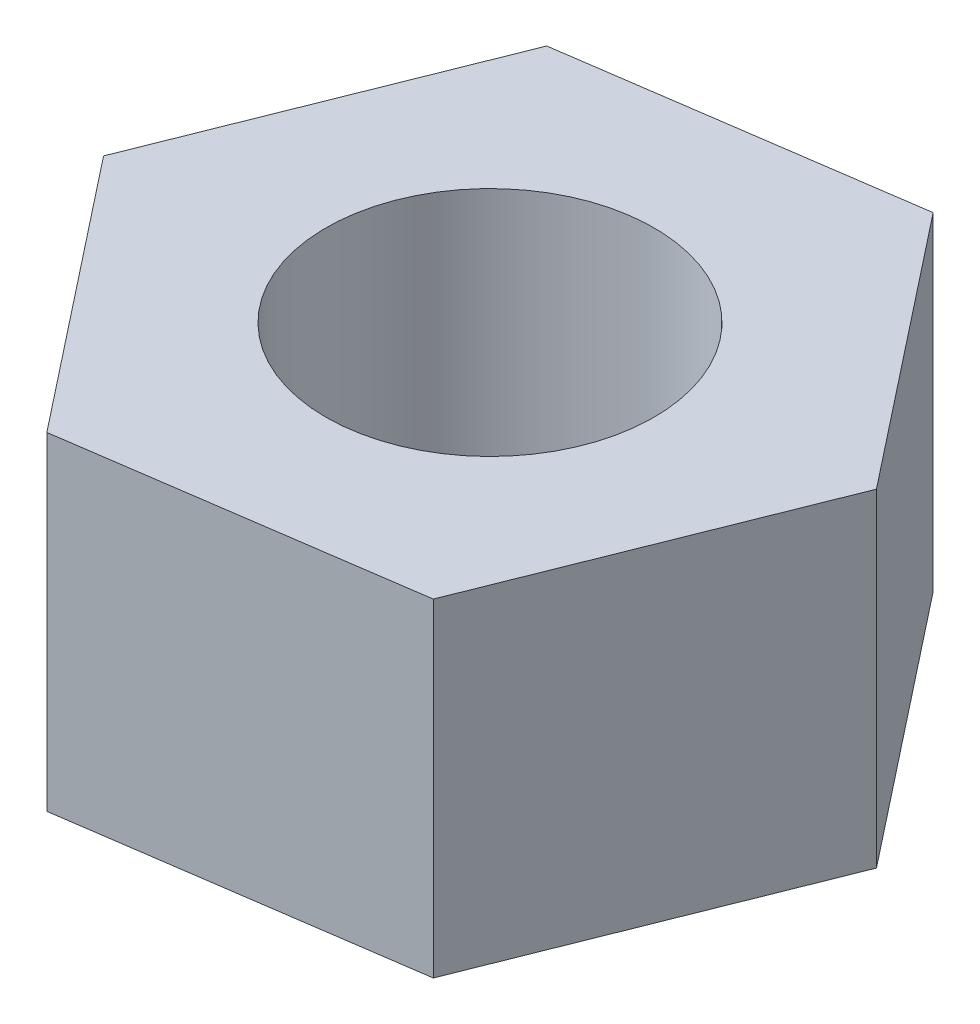
ISO-10303-21;
HEADER;
FILE_DESCRIPTION(('STEP AP214'),'2;1');
FILE_NAME('part.step','',(''),(''),'','','');
FILE_SCHEMA(('AUTOMOTIVE_DESIGN { 1 0 10303 214 1 1 1 1 }'));
ENDSEC;
DATA;
#1=APPLICATION_CONTEXT('core data for automotive mechanical design processes');
#2=APPLICATION_PROTOCOL_DEFINITION('international standard','automotive_design',2000,#1);
#3=PRODUCT_CONTEXT('',#1,'mechanical');
#4=PRODUCT('Part','Part','',(#3));
#5=PRODUCT_RELATED_PRODUCT_CATEGORY('part','',(#4));
#6=PRODUCT_DEFINITION_FORMATION('','',#4);
#7=PRODUCT_DEFINITION_CONTEXT('part definition',#1,'design');
#8=PRODUCT_DEFINITION('design','',#6,#7);
#9=PRODUCT_DEFINITION_SHAPE('','',#8);
#10=(LENGTH_UNIT() NAMED_UNIT(*) SI_UNIT(.MILLI.,.METRE.));
#11=(NAMED_UNIT(*) PLANE_ANGLE_UNIT() SI_UNIT($,.RADIAN.));
#12=(NAMED_UNIT(*) SI_UNIT($,.STERADIAN.) SOLID_ANGLE_UNIT());
#13=UNCERTAINTY_MEASURE_WITH_UNIT(LENGTH_MEASURE(1.E-05),#10,'distance_accuracy_value','');
#14=(GEOMETRIC_REPRESENTATION_CONTEXT(3) GLOBAL_UNCERTAINTY_ASSIGNED_CONTEXT((#13)) GLOBAL_UNIT_ASSIGNED_CONTEXT((#10,
#11,#12)) REPRESENTATION_CONTEXT('',''));
#15=CARTESIAN_POINT('',(0.,0.,0.));
#16=DIRECTION('',(0.,0.,1.));
#17=DIRECTION('',(1.,0.,0.));
#18=AXIS2_PLACEMENT_3D('',#15,#16,#17);
#19=CARTESIAN_POINT('',(-1.15536974050897,3.,2.89570729921314));
#20=DIRECTION('',(-0.143463235607249,0.,-0.989655647197094));
#21=DIRECTION('',(-0.989655647197094,0.,0.143463235607249));
#22=AXIS2_PLACEMENT_3D('',#19,#20,#21);
#23=PLANE('',#22);
#24=DIRECTION('',(0.989655647197094,0.,-0.143463235607249));
#25=VECTOR('',#24,1.);
#26=CARTESIAN_POINT('',(-1.15536974050897,0.,2.89570729921314));
#27=LINE('',#26,#25);
#28=CARTESIAN_POINT('',(-1.15536974050897,0.,2.89570729921314));
#29=VERTEX_POINT('',#28);
#30=CARTESIAN_POINT('',(1.93007121278812,0.,2.44843319565117));
#31=VERTEX_POINT('',#30);
#32=EDGE_CURVE('E128',#29,#31,#27,.T.);
#33=ORIENTED_EDGE('',*,*,#32,.T.);
#34=DIRECTION('',(0.,-1.,0.));
#35=VECTOR('',#34,1.);
#36=CARTESIAN_POINT('',(1.93007121278812,3.,2.44843319565117));
#37=LINE('',#36,#35);
#38=CARTESIAN_POINT('',(1.93007121278812,3.,2.44843319565117));
#39=VERTEX_POINT('',#38);
#40=EDGE_CURVE('E11',#39,#31,#37,.T.);
#41=ORIENTED_EDGE('',*,*,#40,.F.);
#42=DIRECTION('',(0.989655647197094,0.,-0.143463235607249));
#43=VECTOR('',#42,1.);
#44=CARTESIAN_POINT('',(-1.15536974050897,3.,2.89570729921314));
#45=LINE('',#44,#43);
#46=CARTESIAN_POINT('',(-1.15536974050897,3.,2.89570729921314));
#47=VERTEX_POINT('',#46);
#48=EDGE_CURVE('E145',#47,#39,#45,.T.);
#49=ORIENTED_EDGE('',*,*,#48,.F.);
#50=DIRECTION('',(0.,-1.,0.));
#51=VECTOR('',#50,1.);
#52=CARTESIAN_POINT('',(-1.15536974050897,3.,2.89570729921314));
#53=LINE('',#52,#51);
#54=EDGE_CURVE('E124',#47,#29,#53,.T.);
#55=ORIENTED_EDGE('',*,*,#54,.T.);
#56=EDGE_LOOP('',(#33,#41,#49,#55));
#57=FACE_BOUND('',#56,.T.);
#58=ADVANCED_FACE('F39',(#57),#23,.F.);
#59=CARTESIAN_POINT('',(1.93007121278812,3.,2.44843319565117));
#60=DIRECTION('',(-0.928798549275038,0.,-0.370585017053557));
#61=DIRECTION('',(-0.370585017053557,0.,0.928798549275038));
#62=AXIS2_PLACEMENT_3D('',#59,#60,#61);
#63=PLANE('',#62);
#64=DIRECTION('',(0.370585017053557,0.,-0.928798549275038));
#65=VECTOR('',#64,1.);
#66=CARTESIAN_POINT('',(1.93007121278812,0.,2.44843319565117));
#67=LINE('',#66,#65);
#68=CARTESIAN_POINT('',(3.08544095329709,0.,-0.447274103561966));
#69=VERTEX_POINT('',#68);
#70=EDGE_CURVE('E132',#31,#69,#67,.T.);
#71=ORIENTED_EDGE('',*,*,#70,.T.);
#72=DIRECTION('',(0.,-1.,0.));
#73=VECTOR('',#72,1.);
#74=CARTESIAN_POINT('',(3.08544095329709,3.,-0.447274103561966));
#75=LINE('',#74,#73);
#76=CARTESIAN_POINT('',(3.08544095329709,3.,-0.447274103561966));
#77=VERTEX_POINT('',#76);
#78=EDGE_CURVE('E48',#77,#69,#75,.T.);
#79=ORIENTED_EDGE('',*,*,#78,.F.);
#80=DIRECTION('',(0.370585017053557,0.,-0.928798549275038));
#81=VECTOR('',#80,1.);
#82=CARTESIAN_POINT('',(1.93007121278812,3.,2.44843319565117));
#83=LINE('',#82,#81);
#84=EDGE_CURVE('E93',#39,#77,#83,.T.);
#85=ORIENTED_EDGE('',*,*,#84,.F.);
#86=ORIENTED_EDGE('',*,*,#40,.T.);
#87=EDGE_LOOP('',(#71,#79,#85,#86));
#88=FACE_BOUND('',#87,.T.);
#89=ADVANCED_FACE('F174',(#88),#63,.F.);
#90=CARTESIAN_POINT('',(3.08544095329709,3.,-0.447274103561966));
#91=DIRECTION('',(-0.785335313667788,0.,0.619070630143537));
#92=DIRECTION('',(0.619070630143537,0.,0.785335313667788));
#93=AXIS2_PLACEMENT_3D('',#90,#91,#92);
#94=PLANE('',#93);
#95=DIRECTION('',(-0.619070630143537,0.,-0.785335313667788));
#96=VECTOR('',#95,1.);
#97=CARTESIAN_POINT('',(3.08544095329709,0.,-0.447274103561966));
#98=LINE('',#97,#96);
#99=CARTESIAN_POINT('',(1.15536974050897,0.,-2.89570729921314));
#100=VERTEX_POINT('',#99);
#101=EDGE_CURVE('E136',#69,#100,#98,.T.);
#102=ORIENTED_EDGE('',*,*,#101,.T.);
#103=DIRECTION('',(0.,-1.,0.));
#104=VECTOR('',#103,1.);
#105=CARTESIAN_POINT('',(1.15536974050897,3.,-2.89570729921314));
#106=LINE('',#105,#104);
#107=CARTESIAN_POINT('',(1.15536974050897,3.,-2.89570729921314));
#108=VERTEX_POINT('',#107);
#109=EDGE_CURVE('E117',#108,#100,#106,.T.);
#110=ORIENTED_EDGE('',*,*,#109,.F.);
#111=DIRECTION('',(-0.619070630143537,0.,-0.785335313667788));
#112=VECTOR('',#111,1.);
#113=CARTESIAN_POINT('',(3.08544095329709,3.,-0.447274103561966));
#114=LINE('',#113,#112);
#115=EDGE_CURVE('E106',#77,#108,#114,.T.);
#116=ORIENTED_EDGE('',*,*,#115,.F.);
#117=ORIENTED_EDGE('',*,*,#78,.T.);
#118=EDGE_LOOP('',(#102,#110,#116,#117));
#119=FACE_BOUND('',#118,.T.);
#120=ADVANCED_FACE('F155',(#119),#94,.F.);
#121=CARTESIAN_POINT('',(1.15536974050897,3.,-2.89570729921314));
#122=DIRECTION('',(0.14346323560725,0.,0.989655647197094));
#123=DIRECTION('',(0.989655647197094,0.,-0.14346323560725));
#124=AXIS2_PLACEMENT_3D('',#121,#122,#123);
#125=PLANE('',#124);
#126=DIRECTION('',(-0.989655647197094,0.,0.14346323560725));
#127=VECTOR('',#126,1.);
#128=CARTESIAN_POINT('',(1.15536974050897,0.,-2.89570729921314));
#129=LINE('',#128,#127);
#130=CARTESIAN_POINT('',(-1.93007121278812,0.,-2.44843319565117));
#131=VERTEX_POINT('',#130);
#132=EDGE_CURVE('E115',#100,#131,#129,.T.);
#133=ORIENTED_EDGE('',*,*,#132,.T.);
#134=DIRECTION('',(0.,-1.,0.));
#135=VECTOR('',#134,1.);
#136=CARTESIAN_POINT('',(-1.93007121278812,3.,-2.44843319565117));
#137=LINE('',#136,#135);
#138=CARTESIAN_POINT('',(-1.93007121278812,3.,-2.44843319565117));
#139=VERTEX_POINT('',#138);
#140=EDGE_CURVE('E112',#139,#131,#137,.T.);
#141=ORIENTED_EDGE('',*,*,#140,.F.);
#142=DIRECTION('',(-0.989655647197094,0.,0.14346323560725));
#143=VECTOR('',#142,1.);
#144=CARTESIAN_POINT('',(1.15536974050897,3.,-2.89570729921314));
#145=LINE('',#144,#143);
#146=EDGE_CURVE('E100',#108,#139,#145,.T.);
#147=ORIENTED_EDGE('',*,*,#146,.F.);
#148=ORIENTED_EDGE('',*,*,#109,.T.);
#149=EDGE_LOOP('',(#133,#141,#147,#148));
#150=FACE_BOUND('',#149,.T.);
#151=ADVANCED_FACE('F113',(#150),#125,.F.);
#152=CARTESIAN_POINT('',(-1.93007121278812,3.,-2.44843319565117));
#153=DIRECTION('',(0.928798549275038,0.,0.370585017053557));
#154=DIRECTION('',(0.370585017053557,0.,-0.928798549275038));
#155=AXIS2_PLACEMENT_3D('',#152,#153,#154);
#156=PLANE('',#155);
#157=DIRECTION('',(-0.370585017053557,0.,0.928798549275038));
#158=VECTOR('',#157,1.);
#159=CARTESIAN_POINT('',(-1.93007121278812,0.,-2.44843319565117));
#160=LINE('',#159,#158);
#161=CARTESIAN_POINT('',(-3.08544095329709,0.,0.447274103561965));
#162=VERTEX_POINT('',#161);
#163=EDGE_CURVE('E79',#131,#162,#160,.T.);
#164=ORIENTED_EDGE('',*,*,#163,.T.);
#165=DIRECTION('',(0.,-1.,0.));
#166=VECTOR('',#165,1.);
#167=CARTESIAN_POINT('',(-3.08544095329709,3.,0.447274103561965));
#168=LINE('',#167,#166);
#169=CARTESIAN_POINT('',(-3.08544095329709,3.,0.447274103561965));
#170=VERTEX_POINT('',#169);
#171=EDGE_CURVE('E118',#170,#162,#168,.T.);
#172=ORIENTED_EDGE('',*,*,#171,.F.);
#173=DIRECTION('',(-0.370585017053557,0.,0.928798549275038));
#174=VECTOR('',#173,1.);
#175=CARTESIAN_POINT('',(-1.93007121278812,3.,-2.44843319565117));
#176=LINE('',#175,#174);
#177=EDGE_CURVE('E104',#139,#170,#176,.T.);
#178=ORIENTED_EDGE('',*,*,#177,.F.);
#179=ORIENTED_EDGE('',*,*,#140,.T.);
#180=EDGE_LOOP('',(#164,#172,#178,#179));
#181=FACE_BOUND('',#180,.T.);
#182=ADVANCED_FACE('F120',(#181),#156,.F.);
#183=CARTESIAN_POINT('',(-3.08544095329709,3.,0.447274103561965));
#184=DIRECTION('',(0.785335313667788,0.,-0.619070630143537));
#185=DIRECTION('',(-0.619070630143537,0.,-0.785335313667789));
#186=AXIS2_PLACEMENT_3D('',#183,#184,#185);
#187=PLANE('',#186);
#188=DIRECTION('',(0.619070630143537,0.,0.785335313667789));
#189=VECTOR('',#188,1.);
#190=CARTESIAN_POINT('',(-3.08544095329709,0.,0.447274103561965));
#191=LINE('',#190,#189);
#192=EDGE_CURVE('E85',#162,#29,#191,.T.);
#193=ORIENTED_EDGE('',*,*,#192,.T.);
#194=ORIENTED_EDGE('',*,*,#54,.F.);
#195=DIRECTION('',(0.619070630143537,0.,0.785335313667789));
#196=VECTOR('',#195,1.);
#197=CARTESIAN_POINT('',(-3.08544095329709,3.,0.447274103561965));
#198=LINE('',#197,#196);
#199=EDGE_CURVE('E56',#170,#47,#198,.T.);
#200=ORIENTED_EDGE('',*,*,#199,.F.);
#201=ORIENTED_EDGE('',*,*,#171,.T.);
#202=EDGE_LOOP('',(#193,#194,#200,#201));
#203=FACE_BOUND('',#202,.T.);
#204=ADVANCED_FACE('F162',(#203),#187,.F.);
#205=CARTESIAN_POINT('',(0.,3.,0.));
#206=DIRECTION('',(0.,1.,0.));
#207=DIRECTION('',(0.,0.,1.));
#208=AXIS2_PLACEMENT_3D('',#205,#206,#207);
#209=PLANE('',#208);
#210=CARTESIAN_POINT('',(0.,3.,0.));
#211=DIRECTION('',(0.,1.,0.));
#212=DIRECTION('',(0.,0.,1.));
#213=AXIS2_PLACEMENT_3D('',#210,#211,#212);
#214=CIRCLE('',#213,1.5);
#215=CARTESIAN_POINT('',(0.,3.,1.5));
#216=VERTEX_POINT('',#215);
#217=EDGE_CURVE('E229',#216,#216,#214,.T.);
#218=ORIENTED_EDGE('',*,*,#217,.F.);
#219=EDGE_LOOP('',(#218));
#220=FACE_BOUND('',#219,.T.);
#221=ORIENTED_EDGE('',*,*,#48,.T.);
#222=ORIENTED_EDGE('',*,*,#84,.T.);
#223=ORIENTED_EDGE('',*,*,#115,.T.);
#224=ORIENTED_EDGE('',*,*,#146,.T.);
#225=ORIENTED_EDGE('',*,*,#177,.T.);
#226=ORIENTED_EDGE('',*,*,#199,.T.);
#227=EDGE_LOOP('',(#221,#222,#223,#224,#225,#226));
#228=FACE_BOUND('',#227,.T.);
#229=ADVANCED_FACE('F102',(#220,#228),#209,.T.);
#230=CARTESIAN_POINT('',(0.,0.,0.));
#231=DIRECTION('',(0.,1.,0.));
#232=DIRECTION('',(0.,0.,1.));
#233=AXIS2_PLACEMENT_3D('',#230,#231,#232);
#234=PLANE('',#233);
#235=CARTESIAN_POINT('',(0.,0.,0.));
#236=DIRECTION('',(0.,1.,0.));
#237=DIRECTION('',(0.,0.,1.));
#238=AXIS2_PLACEMENT_3D('',#235,#236,#237);
#239=CIRCLE('',#238,1.5);
#240=CARTESIAN_POINT('',(0.,0.,1.5));
#241=VERTEX_POINT('',#240);
#242=EDGE_CURVE('E133',#241,#241,#239,.T.);
#243=ORIENTED_EDGE('',*,*,#242,.T.);
#244=EDGE_LOOP('',(#243));
#245=FACE_BOUND('',#244,.T.);
#246=ORIENTED_EDGE('',*,*,#32,.F.);
#247=ORIENTED_EDGE('',*,*,#192,.F.);
#248=ORIENTED_EDGE('',*,*,#163,.F.);
#249=ORIENTED_EDGE('',*,*,#132,.F.);
#250=ORIENTED_EDGE('',*,*,#101,.F.);
#251=ORIENTED_EDGE('',*,*,#70,.F.);
#252=EDGE_LOOP('',(#246,#247,#248,#249,#250,#251));
#253=FACE_BOUND('',#252,.T.);
#254=ADVANCED_FACE('F158',(#245,#253),#234,.F.);
#255=CARTESIAN_POINT('',(0.,0.,0.));
#256=DIRECTION('',(0.,1.,0.));
#257=DIRECTION('',(0.,0.,1.));
#258=AXIS2_PLACEMENT_3D('',#255,#256,#257);
#259=CYLINDRICAL_SURFACE('',#258,1.5);
#260=ORIENTED_EDGE('',*,*,#242,.F.);
#261=EDGE_LOOP('',(#260));
#262=FACE_BOUND('',#261,.T.);
#263=ORIENTED_EDGE('',*,*,#217,.T.);
#264=EDGE_LOOP('',(#263));
#265=FACE_BOUND('',#264,.T.);
#266=ADVANCED_FACE('F211',(#262,#265),#259,.F.);
#267=CLOSED_SHELL('',(#58,#89,#120,#151,#182,#204,#229,#254,#266));
#268=MANIFOLD_SOLID_BREP('B2',#267);
#269=ADVANCED_BREP_SHAPE_REPRESENTATION('',(#18,#268),#14);
#270=SHAPE_DEFINITION_REPRESENTATION(#9,#269);
ENDSEC;
END-ISO-10303-21;
